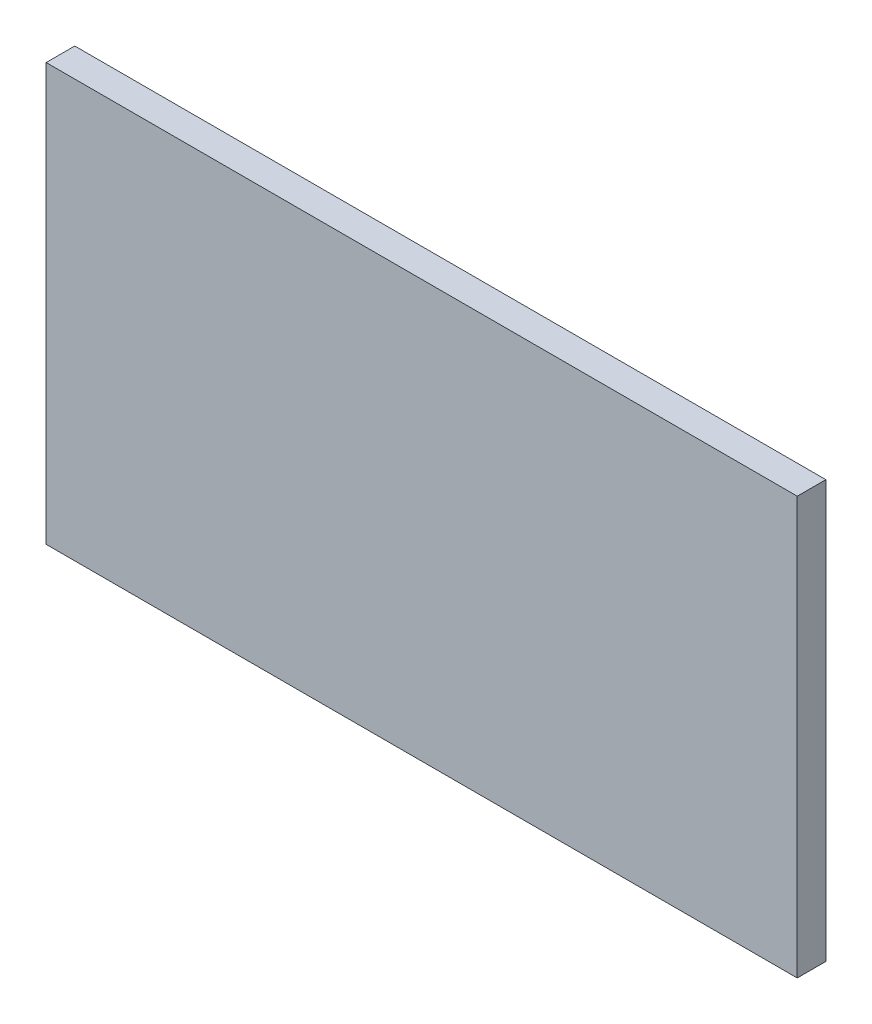
ISO-10303-21;
HEADER;
FILE_DESCRIPTION(('STEP AP214'),'2;1');
FILE_NAME('part.step','',(''),(''),'','','');
FILE_SCHEMA(('AUTOMOTIVE_DESIGN { 1 0 10303 214 1 1 1 1 }'));
ENDSEC;
DATA;
#1=APPLICATION_CONTEXT('core data for automotive mechanical design processes');
#2=APPLICATION_PROTOCOL_DEFINITION('international standard','automotive_design',2000,#1);
#3=PRODUCT_CONTEXT('',#1,'mechanical');
#4=PRODUCT('Part','Part','',(#3));
#5=PRODUCT_RELATED_PRODUCT_CATEGORY('part','',(#4));
#6=PRODUCT_DEFINITION_FORMATION('','',#4);
#7=PRODUCT_DEFINITION_CONTEXT('part definition',#1,'design');
#8=PRODUCT_DEFINITION('design','',#6,#7);
#9=PRODUCT_DEFINITION_SHAPE('','',#8);
#10=(LENGTH_UNIT() NAMED_UNIT(*) SI_UNIT(.MILLI.,.METRE.));
#11=(NAMED_UNIT(*) PLANE_ANGLE_UNIT() SI_UNIT($,.RADIAN.));
#12=(NAMED_UNIT(*) SI_UNIT($,.STERADIAN.) SOLID_ANGLE_UNIT());
#13=UNCERTAINTY_MEASURE_WITH_UNIT(LENGTH_MEASURE(1.E-05),#10,'distance_accuracy_value','');
#14=(GEOMETRIC_REPRESENTATION_CONTEXT(3) GLOBAL_UNCERTAINTY_ASSIGNED_CONTEXT((#13)) GLOBAL_UNIT_ASSIGNED_CONTEXT((#10,
#11,#12)) REPRESENTATION_CONTEXT('',''));
#15=CARTESIAN_POINT('',(0.,0.,0.));
#16=DIRECTION('',(0.,0.,1.));
#17=DIRECTION('',(1.,0.,0.));
#18=AXIS2_PLACEMENT_3D('',#15,#16,#17);
#19=CARTESIAN_POINT('',(0.70008,2.4,0.));
#20=DIRECTION('',(0.,0.,-1.));
#21=DIRECTION('',(-1.,0.,0.));
#22=AXIS2_PLACEMENT_3D('',#19,#20,#21);
#23=PLANE('',#22);
#24=DIRECTION('',(1.,0.,0.));
#25=VECTOR('',#24,1.);
#26=CARTESIAN_POINT('',(0.25008,2.65,0.));
#27=LINE('',#26,#25);
#28=CARTESIAN_POINT('',(0.25008,2.65,0.));
#29=VERTEX_POINT('',#28);
#30=CARTESIAN_POINT('',(1.15008,2.65,0.));
#31=VERTEX_POINT('',#30);
#32=EDGE_CURVE('E55',#29,#31,#27,.T.);
#33=ORIENTED_EDGE('',*,*,#32,.T.);
#34=DIRECTION('',(0.,1.,0.));
#35=VECTOR('',#34,1.);
#36=CARTESIAN_POINT('',(1.15008,2.65,0.));
#37=LINE('',#36,#35);
#38=CARTESIAN_POINT('',(1.15008,2.15,0.));
#39=VERTEX_POINT('',#38);
#40=EDGE_CURVE('E57',#31,#39,#37,.F.);
#41=ORIENTED_EDGE('',*,*,#40,.T.);
#42=DIRECTION('',(1.,0.,0.));
#43=VECTOR('',#42,1.);
#44=CARTESIAN_POINT('',(1.15008,2.15,0.));
#45=LINE('',#44,#43);
#46=CARTESIAN_POINT('',(0.25008,2.15,0.));
#47=VERTEX_POINT('',#46);
#48=EDGE_CURVE('E20',#39,#47,#45,.F.);
#49=ORIENTED_EDGE('',*,*,#48,.T.);
#50=DIRECTION('',(0.,1.,0.));
#51=VECTOR('',#50,1.);
#52=CARTESIAN_POINT('',(0.25008,2.15,0.));
#53=LINE('',#52,#51);
#54=EDGE_CURVE('E80',#47,#29,#53,.T.);
#55=ORIENTED_EDGE('',*,*,#54,.T.);
#56=EDGE_LOOP('',(#33,#41,#49,#55));
#57=FACE_BOUND('',#56,.T.);
#58=ADVANCED_FACE('F17',(#57),#23,.T.);
#59=CARTESIAN_POINT('',(1.15008,2.15,0.));
#60=DIRECTION('',(0.,1.,0.));
#61=DIRECTION('',(0.,0.,1.));
#62=AXIS2_PLACEMENT_3D('',#59,#60,#61);
#63=PLANE('',#62);
#64=DIRECTION('',(0.,0.,-1.));
#65=VECTOR('',#64,1.);
#66=CARTESIAN_POINT('',(0.25008,2.15,0.));
#67=LINE('',#66,#65);
#68=CARTESIAN_POINT('',(0.25008,2.15,0.03429));
#69=VERTEX_POINT('',#68);
#70=EDGE_CURVE('E68',#69,#47,#67,.T.);
#71=ORIENTED_EDGE('',*,*,#70,.T.);
#72=ORIENTED_EDGE('',*,*,#48,.F.);
#73=DIRECTION('',(0.,0.,1.));
#74=VECTOR('',#73,1.);
#75=CARTESIAN_POINT('',(1.15008,2.15,0.));
#76=LINE('',#75,#74);
#77=CARTESIAN_POINT('',(1.15008,2.15,0.03429));
#78=VERTEX_POINT('',#77);
#79=EDGE_CURVE('E63',#39,#78,#76,.T.);
#80=ORIENTED_EDGE('',*,*,#79,.T.);
#81=DIRECTION('',(1.,0.,0.));
#82=VECTOR('',#81,1.);
#83=CARTESIAN_POINT('',(0.70008,2.15,0.03429));
#84=LINE('',#83,#82);
#85=EDGE_CURVE('E83',#69,#78,#84,.T.);
#86=ORIENTED_EDGE('',*,*,#85,.F.);
#87=EDGE_LOOP('',(#71,#72,#80,#86));
#88=FACE_BOUND('',#87,.T.);
#89=ADVANCED_FACE('F65',(#88),#63,.F.);
#90=CARTESIAN_POINT('',(1.15008,2.65,0.));
#91=DIRECTION('',(-1.,0.,0.));
#92=DIRECTION('',(0.,0.,1.));
#93=AXIS2_PLACEMENT_3D('',#90,#91,#92);
#94=PLANE('',#93);
#95=ORIENTED_EDGE('',*,*,#79,.F.);
#96=ORIENTED_EDGE('',*,*,#40,.F.);
#97=DIRECTION('',(0.,0.,-1.));
#98=VECTOR('',#97,1.);
#99=CARTESIAN_POINT('',(1.15008,2.65,0.));
#100=LINE('',#99,#98);
#101=CARTESIAN_POINT('',(1.15008,2.65,0.03429));
#102=VERTEX_POINT('',#101);
#103=EDGE_CURVE('E75',#31,#102,#100,.F.);
#104=ORIENTED_EDGE('',*,*,#103,.T.);
#105=DIRECTION('',(0.,1.,0.));
#106=VECTOR('',#105,1.);
#107=CARTESIAN_POINT('',(1.15008,2.4,0.03429));
#108=LINE('',#107,#106);
#109=EDGE_CURVE('E72',#78,#102,#108,.T.);
#110=ORIENTED_EDGE('',*,*,#109,.F.);
#111=EDGE_LOOP('',(#95,#96,#104,#110));
#112=FACE_BOUND('',#111,.T.);
#113=ADVANCED_FACE('F70',(#112),#94,.F.);
#114=CARTESIAN_POINT('',(0.25008,2.65,0.));
#115=DIRECTION('',(0.,-1.,0.));
#116=DIRECTION('',(0.,0.,-1.));
#117=AXIS2_PLACEMENT_3D('',#114,#115,#116);
#118=PLANE('',#117);
#119=ORIENTED_EDGE('',*,*,#103,.F.);
#120=ORIENTED_EDGE('',*,*,#32,.F.);
#121=DIRECTION('',(0.,0.,-1.));
#122=VECTOR('',#121,1.);
#123=CARTESIAN_POINT('',(0.25008,2.65,0.));
#124=LINE('',#123,#122);
#125=CARTESIAN_POINT('',(0.25008,2.65,0.03429));
#126=VERTEX_POINT('',#125);
#127=EDGE_CURVE('E35',#29,#126,#124,.F.);
#128=ORIENTED_EDGE('',*,*,#127,.T.);
#129=DIRECTION('',(1.,0.,0.));
#130=VECTOR('',#129,1.);
#131=CARTESIAN_POINT('',(0.70008,2.65,0.03429));
#132=LINE('',#131,#130);
#133=EDGE_CURVE('E26',#102,#126,#132,.F.);
#134=ORIENTED_EDGE('',*,*,#133,.F.);
#135=EDGE_LOOP('',(#119,#120,#128,#134));
#136=FACE_BOUND('',#135,.T.);
#137=ADVANCED_FACE('F89',(#136),#118,.F.);
#138=CARTESIAN_POINT('',(0.25008,2.15,0.));
#139=DIRECTION('',(1.,0.,0.));
#140=DIRECTION('',(0.,0.,-1.));
#141=AXIS2_PLACEMENT_3D('',#138,#139,#140);
#142=PLANE('',#141);
#143=ORIENTED_EDGE('',*,*,#127,.F.);
#144=ORIENTED_EDGE('',*,*,#54,.F.);
#145=ORIENTED_EDGE('',*,*,#70,.F.);
#146=DIRECTION('',(0.,1.,0.));
#147=VECTOR('',#146,1.);
#148=CARTESIAN_POINT('',(0.25008,2.4,0.03429));
#149=LINE('',#148,#147);
#150=EDGE_CURVE('E11',#126,#69,#149,.F.);
#151=ORIENTED_EDGE('',*,*,#150,.F.);
#152=EDGE_LOOP('',(#143,#144,#145,#151));
#153=FACE_BOUND('',#152,.T.);
#154=ADVANCED_FACE('F91',(#153),#142,.F.);
#155=CARTESIAN_POINT('',(0.70008,2.4,0.03429));
#156=DIRECTION('',(0.,0.,1.));
#157=DIRECTION('',(1.,0.,0.));
#158=AXIS2_PLACEMENT_3D('',#155,#156,#157);
#159=PLANE('',#158);
#160=ORIENTED_EDGE('',*,*,#133,.T.);
#161=ORIENTED_EDGE('',*,*,#150,.T.);
#162=ORIENTED_EDGE('',*,*,#85,.T.);
#163=ORIENTED_EDGE('',*,*,#109,.T.);
#164=EDGE_LOOP('',(#160,#161,#162,#163));
#165=FACE_BOUND('',#164,.T.);
#166=ADVANCED_FACE('F88',(#165),#159,.T.);
#167=CLOSED_SHELL('',(#58,#89,#113,#137,#154,#166));
#168=MANIFOLD_SOLID_BREP('B1',#167);
#169=ADVANCED_BREP_SHAPE_REPRESENTATION('',(#18,#168),#14);
#170=SHAPE_DEFINITION_REPRESENTATION(#9,#169);
ENDSEC;
END-ISO-10303-21;
